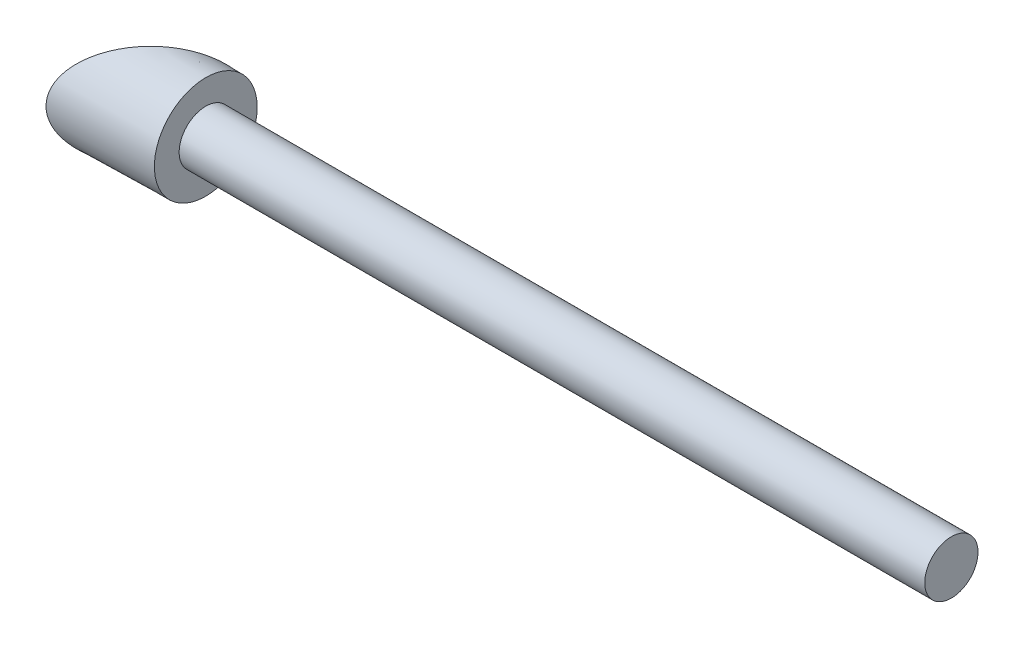
ISO-10303-21;
HEADER;
FILE_DESCRIPTION(('STEP AP214'),'2;1');
FILE_NAME('part.step','',(''),(''),'','','');
FILE_SCHEMA(('AUTOMOTIVE_DESIGN { 1 0 10303 214 1 1 1 1 }'));
ENDSEC;
DATA;
#1=APPLICATION_CONTEXT('core data for automotive mechanical design processes');
#2=APPLICATION_PROTOCOL_DEFINITION('international standard','automotive_design',2000,#1);
#3=PRODUCT_CONTEXT('',#1,'mechanical');
#4=PRODUCT('Part','Part','',(#3));
#5=PRODUCT_RELATED_PRODUCT_CATEGORY('part','',(#4));
#6=PRODUCT_DEFINITION_FORMATION('','',#4);
#7=PRODUCT_DEFINITION_CONTEXT('part definition',#1,'design');
#8=PRODUCT_DEFINITION('design','',#6,#7);
#9=PRODUCT_DEFINITION_SHAPE('','',#8);
#10=(LENGTH_UNIT() NAMED_UNIT(*) SI_UNIT(.MILLI.,.METRE.));
#11=(NAMED_UNIT(*) PLANE_ANGLE_UNIT() SI_UNIT($,.RADIAN.));
#12=(NAMED_UNIT(*) SI_UNIT($,.STERADIAN.) SOLID_ANGLE_UNIT());
#13=UNCERTAINTY_MEASURE_WITH_UNIT(LENGTH_MEASURE(1.E-05),#10,'distance_accuracy_value','');
#14=(GEOMETRIC_REPRESENTATION_CONTEXT(3) GLOBAL_UNCERTAINTY_ASSIGNED_CONTEXT((#13)) GLOBAL_UNIT_ASSIGNED_CONTEXT((#10,
#11,#12)) REPRESENTATION_CONTEXT('',''));
#15=CARTESIAN_POINT('',(0.,0.,0.));
#16=DIRECTION('',(0.,0.,1.));
#17=DIRECTION('',(1.,0.,0.));
#18=AXIS2_PLACEMENT_3D('',#15,#16,#17);
#19=CARTESIAN_POINT('',(0.,0.,0.));
#20=DIRECTION('',(-1.,0.,0.));
#21=DIRECTION('',(0.,0.,-1.));
#22=AXIS2_PLACEMENT_3D('',#19,#20,#21);
#23=CONICAL_SURFACE('',#22,2.5,0.0174532925199433);
#24=CARTESIAN_POINT('',(2.5,0.,0.0436376623205441));
#25=DIRECTION('',(0.700853985877924,0.,0.713304766897731));
#26=DIRECTION('',(-0.713304766897731,0.,0.700853985877924));
#27=AXIS2_PLACEMENT_3D('',#24,#25,#26);
#28=ELLIPSE('',#27,3.50481325236739,2.4559746921329);
#29=CARTESIAN_POINT('',(5.,0.,-2.41272467535891));
#30=VERTEX_POINT('',#29);
#31=EDGE_CURVE('E38',#30,#30,#28,.T.);
#32=ORIENTED_EDGE('',*,*,#31,.T.);
#33=CARTESIAN_POINT('',(5.,0.,0.));
#34=DIRECTION('',(1.,0.,0.));
#35=DIRECTION('',(0.,0.,-1.));
#36=AXIS2_PLACEMENT_3D('',#33,#34,#35);
#37=CIRCLE('',#36,2.41272467535891);
#38=EDGE_CURVE('E11',#30,#30,#37,.T.);
#39=ORIENTED_EDGE('',*,*,#38,.F.);
#40=EDGE_LOOP('',(#32,#39));
#41=FACE_BOUND('',#40,.T.);
#42=ADVANCED_FACE('F32',(#41),#23,.T.);
#43=CARTESIAN_POINT('',(5.,0.,0.));
#44=DIRECTION('',(1.,0.,0.));
#45=DIRECTION('',(0.,0.,-1.));
#46=AXIS2_PLACEMENT_3D('',#43,#44,#45);
#47=PLANE('',#46);
#48=CARTESIAN_POINT('',(5.,0.,0.));
#49=DIRECTION('',(1.,0.,0.));
#50=DIRECTION('',(0.,0.,-1.));
#51=AXIS2_PLACEMENT_3D('',#48,#49,#50);
#52=CIRCLE('',#51,1.25);
#53=CARTESIAN_POINT('',(5.,0.,-1.25));
#54=VERTEX_POINT('',#53);
#55=EDGE_CURVE('E46',#54,#54,#52,.T.);
#56=ORIENTED_EDGE('',*,*,#55,.F.);
#57=EDGE_LOOP('',(#56));
#58=FACE_BOUND('',#57,.T.);
#59=ORIENTED_EDGE('',*,*,#38,.T.);
#60=EDGE_LOOP('',(#59));
#61=FACE_BOUND('',#60,.T.);
#62=ADVANCED_FACE('F54',(#58,#61),#47,.T.);
#63=CARTESIAN_POINT('',(1.249806222565,2.5,1.27200922619757));
#64=DIRECTION('',(0.700853985877924,0.,0.713304766897731));
#65=DIRECTION('',(0.713304766897731,0.,-0.700853985877924));
#66=AXIS2_PLACEMENT_3D('',#63,#64,#65);
#67=PLANE('',#66);
#68=ORIENTED_EDGE('',*,*,#31,.F.);
#69=EDGE_LOOP('',(#68));
#70=FACE_BOUND('',#69,.T.);
#71=ADVANCED_FACE('F57',(#70),#67,.F.);
#72=CARTESIAN_POINT('',(40.,0.,0.));
#73=DIRECTION('',(-1.,0.,0.));
#74=DIRECTION('',(0.,0.,1.));
#75=AXIS2_PLACEMENT_3D('',#72,#73,#74);
#76=CYLINDRICAL_SURFACE('',#75,1.25);
#77=CARTESIAN_POINT('',(40.,0.,0.));
#78=DIRECTION('',(1.,0.,0.));
#79=DIRECTION('',(0.,0.,-1.));
#80=AXIS2_PLACEMENT_3D('',#77,#78,#79);
#81=CIRCLE('',#80,1.25);
#82=CARTESIAN_POINT('',(40.,0.,-1.25));
#83=VERTEX_POINT('',#82);
#84=EDGE_CURVE('E44',#83,#83,#81,.T.);
#85=ORIENTED_EDGE('',*,*,#84,.F.);
#86=EDGE_LOOP('',(#85));
#87=FACE_BOUND('',#86,.T.);
#88=ORIENTED_EDGE('',*,*,#55,.T.);
#89=EDGE_LOOP('',(#88));
#90=FACE_BOUND('',#89,.T.);
#91=ADVANCED_FACE('F52',(#87,#90),#76,.T.);
#92=CARTESIAN_POINT('',(40.,0.,0.));
#93=DIRECTION('',(1.,0.,0.));
#94=DIRECTION('',(0.,0.,-1.));
#95=AXIS2_PLACEMENT_3D('',#92,#93,#94);
#96=PLANE('',#95);
#97=ORIENTED_EDGE('',*,*,#84,.T.);
#98=EDGE_LOOP('',(#97));
#99=FACE_BOUND('',#98,.T.);
#100=ADVANCED_FACE('F66',(#99),#96,.T.);
#101=CLOSED_SHELL('',(#42,#62,#71,#91,#100));
#102=MANIFOLD_SOLID_BREP('B2',#101);
#103=ADVANCED_BREP_SHAPE_REPRESENTATION('',(#18,#102),#14);
#104=SHAPE_DEFINITION_REPRESENTATION(#9,#103);
ENDSEC;
END-ISO-10303-21;
